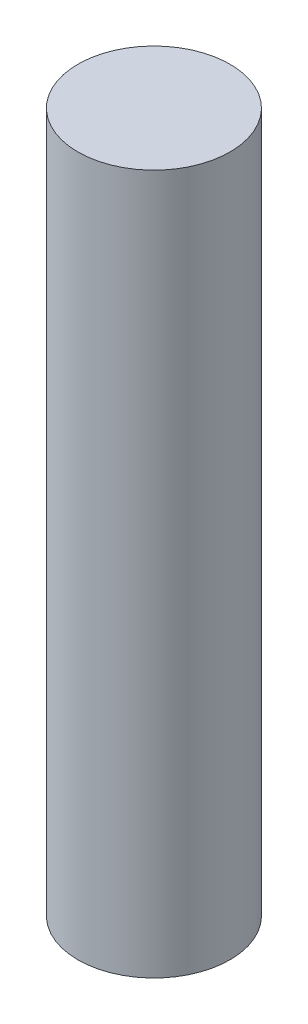
ISO-10303-21;
HEADER;
FILE_DESCRIPTION(('STEP AP214'),'2;1');
FILE_NAME('part.step','',(''),(''),'','','');
FILE_SCHEMA(('AUTOMOTIVE_DESIGN { 1 0 10303 214 1 1 1 1 }'));
ENDSEC;
DATA;
#1=APPLICATION_CONTEXT('core data for automotive mechanical design processes');
#2=APPLICATION_PROTOCOL_DEFINITION('international standard','automotive_design',2000,#1);
#3=PRODUCT_CONTEXT('',#1,'mechanical');
#4=PRODUCT('Part','Part','',(#3));
#5=PRODUCT_RELATED_PRODUCT_CATEGORY('part','',(#4));
#6=PRODUCT_DEFINITION_FORMATION('','',#4);
#7=PRODUCT_DEFINITION_CONTEXT('part definition',#1,'design');
#8=PRODUCT_DEFINITION('design','',#6,#7);
#9=PRODUCT_DEFINITION_SHAPE('','',#8);
#10=(LENGTH_UNIT() NAMED_UNIT(*) SI_UNIT(.MILLI.,.METRE.));
#11=(NAMED_UNIT(*) PLANE_ANGLE_UNIT() SI_UNIT($,.RADIAN.));
#12=(NAMED_UNIT(*) SI_UNIT($,.STERADIAN.) SOLID_ANGLE_UNIT());
#13=UNCERTAINTY_MEASURE_WITH_UNIT(LENGTH_MEASURE(1.E-05),#10,'distance_accuracy_value','');
#14=(GEOMETRIC_REPRESENTATION_CONTEXT(3) GLOBAL_UNCERTAINTY_ASSIGNED_CONTEXT((#13)) GLOBAL_UNIT_ASSIGNED_CONTEXT((#10,
#11,#12)) REPRESENTATION_CONTEXT('',''));
#15=CARTESIAN_POINT('',(0.,0.,0.));
#16=DIRECTION('',(0.,0.,1.));
#17=DIRECTION('',(1.,0.,0.));
#18=AXIS2_PLACEMENT_3D('',#15,#16,#17);
#19=CARTESIAN_POINT('',(0.,23.,0.));
#20=DIRECTION('',(0.,-1.,0.));
#21=DIRECTION('',(0.,0.,-1.));
#22=AXIS2_PLACEMENT_3D('',#19,#20,#21);
#23=CYLINDRICAL_SURFACE('',#22,2.5);
#24=CARTESIAN_POINT('',(0.,23.,0.));
#25=DIRECTION('',(0.,1.,0.));
#26=DIRECTION('',(0.,0.,1.));
#27=AXIS2_PLACEMENT_3D('',#24,#25,#26);
#28=CIRCLE('',#27,2.5);
#29=CARTESIAN_POINT('',(0.,23.,2.5));
#30=VERTEX_POINT('',#29);
#31=EDGE_CURVE('E10',#30,#30,#28,.T.);
#32=ORIENTED_EDGE('',*,*,#31,.F.);
#33=EDGE_LOOP('',(#32));
#34=FACE_BOUND('',#33,.T.);
#35=CARTESIAN_POINT('',(0.,0.,0.));
#36=DIRECTION('',(0.,1.,0.));
#37=DIRECTION('',(0.,0.,1.));
#38=AXIS2_PLACEMENT_3D('',#35,#36,#37);
#39=CIRCLE('',#38,2.5);
#40=CARTESIAN_POINT('',(0.,0.,2.5));
#41=VERTEX_POINT('',#40);
#42=EDGE_CURVE('E40',#41,#41,#39,.T.);
#43=ORIENTED_EDGE('',*,*,#42,.T.);
#44=EDGE_LOOP('',(#43));
#45=FACE_BOUND('',#44,.T.);
#46=ADVANCED_FACE('F37',(#34,#45),#23,.T.);
#47=CARTESIAN_POINT('',(0.,23.,0.));
#48=DIRECTION('',(0.,1.,0.));
#49=DIRECTION('',(0.,0.,1.));
#50=AXIS2_PLACEMENT_3D('',#47,#48,#49);
#51=PLANE('',#50);
#52=ORIENTED_EDGE('',*,*,#31,.T.);
#53=EDGE_LOOP('',(#52));
#54=FACE_BOUND('',#53,.T.);
#55=ADVANCED_FACE('F54',(#54),#51,.T.);
#56=CARTESIAN_POINT('',(0.,0.,0.));
#57=DIRECTION('',(0.,1.,0.));
#58=DIRECTION('',(0.,0.,1.));
#59=AXIS2_PLACEMENT_3D('',#56,#57,#58);
#60=PLANE('',#59);
#61=ORIENTED_EDGE('',*,*,#42,.F.);
#62=EDGE_LOOP('',(#61));
#63=FACE_BOUND('',#62,.T.);
#64=ADVANCED_FACE('F52',(#63),#60,.F.);
#65=CLOSED_SHELL('',(#46,#55,#64));
#66=MANIFOLD_SOLID_BREP('B2',#65);
#67=ADVANCED_BREP_SHAPE_REPRESENTATION('',(#18,#66),#14);
#68=SHAPE_DEFINITION_REPRESENTATION(#9,#67);
ENDSEC;
END-ISO-10303-21;
